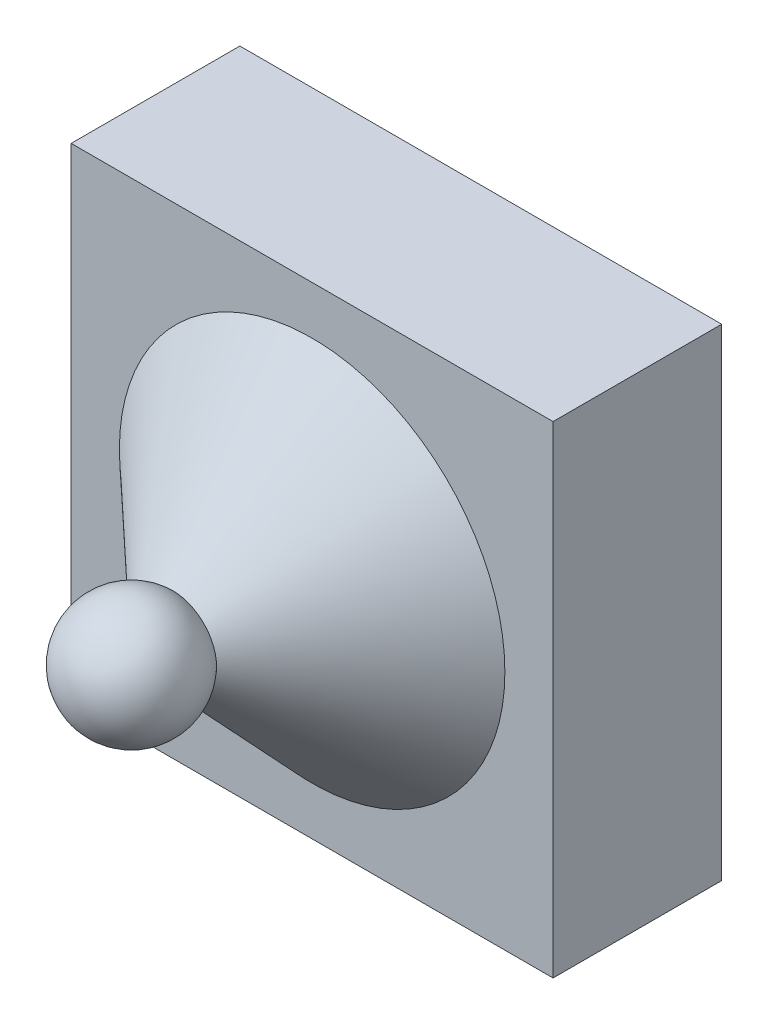
ISO-10303-21;
HEADER;
FILE_DESCRIPTION(('STEP AP214'),'2;1');
FILE_NAME('part.step','',(''),(''),'','','');
FILE_SCHEMA(('AUTOMOTIVE_DESIGN { 1 0 10303 214 1 1 1 1 }'));
ENDSEC;
DATA;
#1=APPLICATION_CONTEXT('core data for automotive mechanical design processes');
#2=APPLICATION_PROTOCOL_DEFINITION('international standard','automotive_design',2000,#1);
#3=PRODUCT_CONTEXT('',#1,'mechanical');
#4=PRODUCT('Part','Part','',(#3));
#5=PRODUCT_RELATED_PRODUCT_CATEGORY('part','',(#4));
#6=PRODUCT_DEFINITION_FORMATION('','',#4);
#7=PRODUCT_DEFINITION_CONTEXT('part definition',#1,'design');
#8=PRODUCT_DEFINITION('design','',#6,#7);
#9=PRODUCT_DEFINITION_SHAPE('','',#8);
#10=(LENGTH_UNIT() NAMED_UNIT(*) SI_UNIT(.MILLI.,.METRE.));
#11=(NAMED_UNIT(*) PLANE_ANGLE_UNIT() SI_UNIT($,.RADIAN.));
#12=(NAMED_UNIT(*) SI_UNIT($,.STERADIAN.) SOLID_ANGLE_UNIT());
#13=UNCERTAINTY_MEASURE_WITH_UNIT(LENGTH_MEASURE(1.E-05),#10,'distance_accuracy_value','');
#14=(GEOMETRIC_REPRESENTATION_CONTEXT(3) GLOBAL_UNCERTAINTY_ASSIGNED_CONTEXT((#13)) GLOBAL_UNIT_ASSIGNED_CONTEXT((#10,
#11,#12)) REPRESENTATION_CONTEXT('',''));
#15=CARTESIAN_POINT('',(0.,0.,0.));
#16=DIRECTION('',(0.,0.,1.));
#17=DIRECTION('',(1.,0.,0.));
#18=AXIS2_PLACEMENT_3D('',#15,#16,#17);
#19=CARTESIAN_POINT('',(50.,-50.,35.));
#20=DIRECTION('',(-1.,0.,0.));
#21=DIRECTION('',(0.,0.,1.));
#22=AXIS2_PLACEMENT_3D('',#19,#20,#21);
#23=PLANE('',#22);
#24=DIRECTION('',(0.,1.,0.));
#25=VECTOR('',#24,1.);
#26=CARTESIAN_POINT('',(50.,-50.,0.));
#27=LINE('',#26,#25);
#28=CARTESIAN_POINT('',(50.,-50.,0.));
#29=VERTEX_POINT('',#28);
#30=CARTESIAN_POINT('',(50.,50.,0.));
#31=VERTEX_POINT('',#30);
#32=EDGE_CURVE('E98',#29,#31,#27,.T.);
#33=ORIENTED_EDGE('',*,*,#32,.T.);
#34=DIRECTION('',(0.,0.,-1.));
#35=VECTOR('',#34,1.);
#36=CARTESIAN_POINT('',(50.,50.,35.));
#37=LINE('',#36,#35);
#38=CARTESIAN_POINT('',(50.,50.,35.));
#39=VERTEX_POINT('',#38);
#40=EDGE_CURVE('E11',#39,#31,#37,.T.);
#41=ORIENTED_EDGE('',*,*,#40,.F.);
#42=DIRECTION('',(0.,1.,0.));
#43=VECTOR('',#42,1.);
#44=CARTESIAN_POINT('',(50.,-50.,35.));
#45=LINE('',#44,#43);
#46=CARTESIAN_POINT('',(50.,-50.,35.));
#47=VERTEX_POINT('',#46);
#48=EDGE_CURVE('E86',#47,#39,#45,.T.);
#49=ORIENTED_EDGE('',*,*,#48,.F.);
#50=DIRECTION('',(0.,0.,-1.));
#51=VECTOR('',#50,1.);
#52=CARTESIAN_POINT('',(50.,-50.,35.));
#53=LINE('',#52,#51);
#54=EDGE_CURVE('E94',#47,#29,#53,.T.);
#55=ORIENTED_EDGE('',*,*,#54,.T.);
#56=EDGE_LOOP('',(#33,#41,#49,#55));
#57=FACE_BOUND('',#56,.T.);
#58=ADVANCED_FACE('F35',(#57),#23,.F.);
#59=CARTESIAN_POINT('',(-50.,50.,35.));
#60=DIRECTION('',(0.,-1.,0.));
#61=DIRECTION('',(0.,0.,-1.));
#62=AXIS2_PLACEMENT_3D('',#59,#60,#61);
#63=PLANE('',#62);
#64=DIRECTION('',(-1.,0.,0.));
#65=VECTOR('',#64,1.);
#66=CARTESIAN_POINT('',(-50.,50.,0.));
#67=LINE('',#66,#65);
#68=CARTESIAN_POINT('',(-50.,50.,0.));
#69=VERTEX_POINT('',#68);
#70=EDGE_CURVE('E90',#31,#69,#67,.T.);
#71=ORIENTED_EDGE('',*,*,#70,.T.);
#72=DIRECTION('',(0.,0.,-1.));
#73=VECTOR('',#72,1.);
#74=CARTESIAN_POINT('',(-50.,50.,35.));
#75=LINE('',#74,#73);
#76=CARTESIAN_POINT('',(-50.,50.,35.));
#77=VERTEX_POINT('',#76);
#78=EDGE_CURVE('E43',#77,#69,#75,.T.);
#79=ORIENTED_EDGE('',*,*,#78,.F.);
#80=DIRECTION('',(-1.,0.,0.));
#81=VECTOR('',#80,1.);
#82=CARTESIAN_POINT('',(-50.,50.,35.));
#83=LINE('',#82,#81);
#84=EDGE_CURVE('E81',#39,#77,#83,.T.);
#85=ORIENTED_EDGE('',*,*,#84,.F.);
#86=ORIENTED_EDGE('',*,*,#40,.T.);
#87=EDGE_LOOP('',(#71,#79,#85,#86));
#88=FACE_BOUND('',#87,.T.);
#89=ADVANCED_FACE('F89',(#88),#63,.F.);
#90=CARTESIAN_POINT('',(-50.,-50.,35.));
#91=DIRECTION('',(1.,0.,0.));
#92=DIRECTION('',(0.,0.,-1.));
#93=AXIS2_PLACEMENT_3D('',#90,#91,#92);
#94=PLANE('',#93);
#95=DIRECTION('',(0.,-1.,0.));
#96=VECTOR('',#95,1.);
#97=CARTESIAN_POINT('',(-50.,-50.,0.));
#98=LINE('',#97,#96);
#99=CARTESIAN_POINT('',(-50.,-50.,0.));
#100=VERTEX_POINT('',#99);
#101=EDGE_CURVE('E68',#69,#100,#98,.T.);
#102=ORIENTED_EDGE('',*,*,#101,.T.);
#103=DIRECTION('',(0.,0.,-1.));
#104=VECTOR('',#103,1.);
#105=CARTESIAN_POINT('',(-50.,-50.,35.));
#106=LINE('',#105,#104);
#107=CARTESIAN_POINT('',(-50.,-50.,35.));
#108=VERTEX_POINT('',#107);
#109=EDGE_CURVE('E91',#108,#100,#106,.T.);
#110=ORIENTED_EDGE('',*,*,#109,.F.);
#111=DIRECTION('',(0.,-1.,0.));
#112=VECTOR('',#111,1.);
#113=CARTESIAN_POINT('',(-50.,-50.,35.));
#114=LINE('',#113,#112);
#115=EDGE_CURVE('E84',#77,#108,#114,.T.);
#116=ORIENTED_EDGE('',*,*,#115,.F.);
#117=ORIENTED_EDGE('',*,*,#78,.T.);
#118=EDGE_LOOP('',(#102,#110,#116,#117));
#119=FACE_BOUND('',#118,.T.);
#120=ADVANCED_FACE('F92',(#119),#94,.F.);
#121=CARTESIAN_POINT('',(-50.,-50.,35.));
#122=DIRECTION('',(0.,1.,0.));
#123=DIRECTION('',(0.,0.,1.));
#124=AXIS2_PLACEMENT_3D('',#121,#122,#123);
#125=PLANE('',#124);
#126=DIRECTION('',(1.,0.,0.));
#127=VECTOR('',#126,1.);
#128=CARTESIAN_POINT('',(-50.,-50.,0.));
#129=LINE('',#128,#127);
#130=EDGE_CURVE('E74',#100,#29,#129,.T.);
#131=ORIENTED_EDGE('',*,*,#130,.T.);
#132=ORIENTED_EDGE('',*,*,#54,.F.);
#133=DIRECTION('',(1.,0.,0.));
#134=VECTOR('',#133,1.);
#135=CARTESIAN_POINT('',(-50.,-50.,35.));
#136=LINE('',#135,#134);
#137=EDGE_CURVE('E51',#108,#47,#136,.T.);
#138=ORIENTED_EDGE('',*,*,#137,.F.);
#139=ORIENTED_EDGE('',*,*,#109,.T.);
#140=EDGE_LOOP('',(#131,#132,#138,#139));
#141=FACE_BOUND('',#140,.T.);
#142=ADVANCED_FACE('F106',(#141),#125,.F.);
#143=CARTESIAN_POINT('',(0.,0.,35.));
#144=DIRECTION('',(0.,0.,-1.));
#145=DIRECTION('',(-1.,0.,0.));
#146=AXIS2_PLACEMENT_3D('',#143,#144,#145);
#147=PLANE('',#146);
#148=CARTESIAN_POINT('',(0.,0.,35.));
#149=DIRECTION('',(0.,0.,-1.));
#150=DIRECTION('',(-1.,0.,0.));
#151=AXIS2_PLACEMENT_3D('',#148,#149,#150);
#152=CIRCLE('',#151,40.);
#153=CARTESIAN_POINT('',(-40.,0.,35.));
#154=VERTEX_POINT('',#153);
#155=EDGE_CURVE('E114',#154,#154,#152,.T.);
#156=ORIENTED_EDGE('',*,*,#155,.T.);
#157=EDGE_LOOP('',(#156));
#158=FACE_BOUND('',#157,.T.);
#159=ORIENTED_EDGE('',*,*,#48,.T.);
#160=ORIENTED_EDGE('',*,*,#84,.T.);
#161=ORIENTED_EDGE('',*,*,#115,.T.);
#162=ORIENTED_EDGE('',*,*,#137,.T.);
#163=EDGE_LOOP('',(#159,#160,#161,#162));
#164=FACE_BOUND('',#163,.T.);
#165=ADVANCED_FACE('F82',(#158,#164),#147,.F.);
#166=CARTESIAN_POINT('',(0.,0.,0.));
#167=DIRECTION('',(0.,0.,-1.));
#168=DIRECTION('',(-1.,0.,0.));
#169=AXIS2_PLACEMENT_3D('',#166,#167,#168);
#170=PLANE('',#169);
#171=ORIENTED_EDGE('',*,*,#32,.F.);
#172=ORIENTED_EDGE('',*,*,#130,.F.);
#173=ORIENTED_EDGE('',*,*,#101,.F.);
#174=ORIENTED_EDGE('',*,*,#70,.F.);
#175=EDGE_LOOP('',(#171,#172,#173,#174));
#176=FACE_BOUND('',#175,.T.);
#177=ADVANCED_FACE('F109',(#176),#170,.T.);
#178=CARTESIAN_POINT('',(0.,0.,72.5));
#179=DIRECTION('',(0.,0.,-1.));
#180=DIRECTION('',(1.,0.,0.));
#181=AXIS2_PLACEMENT_3D('',#178,#179,#180);
#182=SPHERICAL_SURFACE('',#181,12.5);
#183=CARTESIAN_POINT('',(0.,0.,63.9507358889834));
#184=DIRECTION('',(0.,0.,-1.));
#185=DIRECTION('',(-1.,0.,0.));
#186=AXIS2_PLACEMENT_3D('',#183,#184,#185);
#187=CIRCLE('',#186,9.11921505175106);
#188=CARTESIAN_POINT('',(-9.11921505175106,0.,63.9507358889834));
#189=VERTEX_POINT('',#188);
#190=EDGE_CURVE('E101',#189,#189,#187,.T.);
#191=ORIENTED_EDGE('',*,*,#190,.F.);
#192=EDGE_LOOP('',(#191));
#193=FACE_BOUND('',#192,.T.);
#194=ADVANCED_FACE('F122',(#193),#182,.T.);
#195=CARTESIAN_POINT('',(0.,0.,63.9507358889834));
#196=DIRECTION('',(0.,0.,-1.));
#197=DIRECTION('',(-1.,0.,0.));
#198=AXIS2_PLACEMENT_3D('',#195,#196,#197);
#199=CONICAL_SURFACE('',#198,9.11921505175106,0.817645045832702);
#200=ORIENTED_EDGE('',*,*,#155,.F.);
#201=EDGE_LOOP('',(#200));
#202=FACE_BOUND('',#201,.T.);
#203=ORIENTED_EDGE('',*,*,#190,.T.);
#204=EDGE_LOOP('',(#203));
#205=FACE_BOUND('',#204,.T.);
#206=ADVANCED_FACE('F119',(#202,#205),#199,.T.);
#207=CLOSED_SHELL('',(#58,#89,#120,#142,#165,#177,#194,#206));
#208=MANIFOLD_SOLID_BREP('B2',#207);
#209=ADVANCED_BREP_SHAPE_REPRESENTATION('',(#18,#208),#14);
#210=SHAPE_DEFINITION_REPRESENTATION(#9,#209);
ENDSEC;
END-ISO-10303-21;
